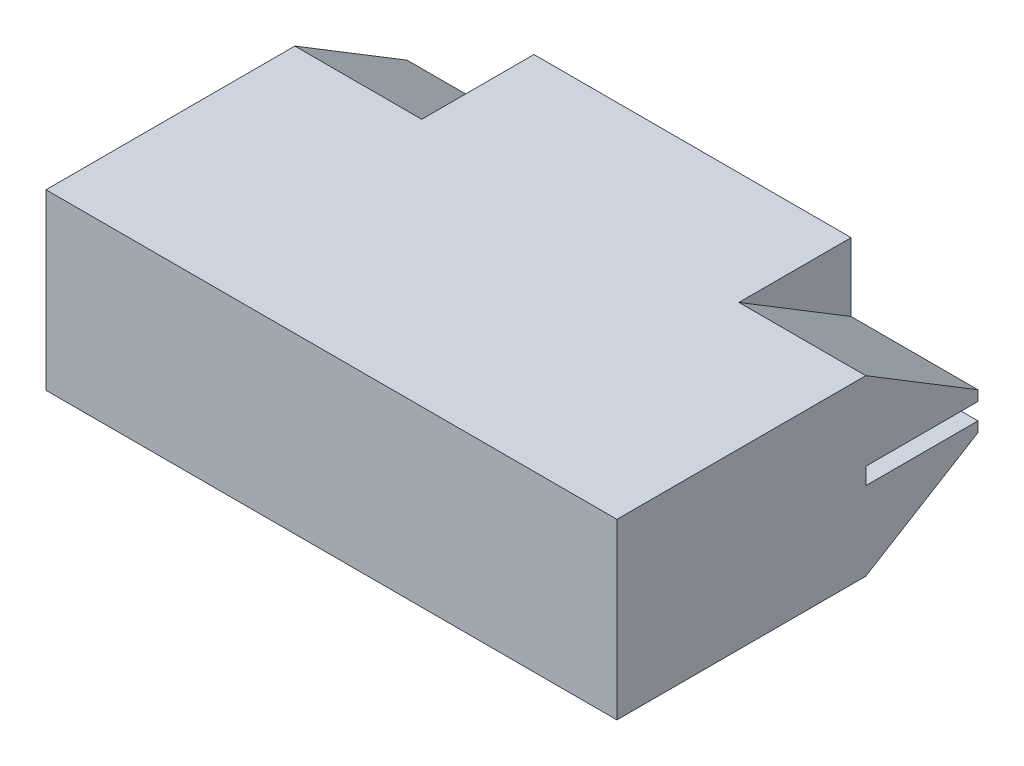
ISO-10303-21;
HEADER;
FILE_DESCRIPTION(('STEP AP214'),'2;1');
FILE_NAME('part.step','',(''),(''),'','','');
FILE_SCHEMA(('AUTOMOTIVE_DESIGN { 1 0 10303 214 1 1 1 1 }'));
ENDSEC;
DATA;
#1=APPLICATION_CONTEXT('core data for automotive mechanical design processes');
#2=APPLICATION_PROTOCOL_DEFINITION('international standard','automotive_design',2000,#1);
#3=PRODUCT_CONTEXT('',#1,'mechanical');
#4=PRODUCT('Part','Part','',(#3));
#5=PRODUCT_RELATED_PRODUCT_CATEGORY('part','',(#4));
#6=PRODUCT_DEFINITION_FORMATION('','',#4);
#7=PRODUCT_DEFINITION_CONTEXT('part definition',#1,'design');
#8=PRODUCT_DEFINITION('design','',#6,#7);
#9=PRODUCT_DEFINITION_SHAPE('','',#8);
#10=(LENGTH_UNIT() NAMED_UNIT(*) SI_UNIT(.MILLI.,.METRE.));
#11=(NAMED_UNIT(*) PLANE_ANGLE_UNIT() SI_UNIT($,.RADIAN.));
#12=(NAMED_UNIT(*) SI_UNIT($,.STERADIAN.) SOLID_ANGLE_UNIT());
#13=UNCERTAINTY_MEASURE_WITH_UNIT(LENGTH_MEASURE(1.E-05),#10,'distance_accuracy_value','');
#14=(GEOMETRIC_REPRESENTATION_CONTEXT(3) GLOBAL_UNCERTAINTY_ASSIGNED_CONTEXT((#13)) GLOBAL_UNIT_ASSIGNED_CONTEXT((#10,
#11,#12)) REPRESENTATION_CONTEXT('',''));
#15=CARTESIAN_POINT('',(0.,0.,0.));
#16=DIRECTION('',(0.,0.,1.));
#17=DIRECTION('',(1.,0.,0.));
#18=AXIS2_PLACEMENT_3D('',#15,#16,#17);
#19=CARTESIAN_POINT('',(6.625,-0.473000000000003,-3.2125));
#20=DIRECTION('',(1.,0.,0.));
#21=DIRECTION('',(0.,0.,-1.));
#22=AXIS2_PLACEMENT_3D('',#19,#20,#21);
#23=PLANE('',#22);
#24=DIRECTION('',(0.,0.,1.));
#25=VECTOR('',#24,1.);
#26=CARTESIAN_POINT('',(6.625,-0.430000000000002,-9.5375));
#27=LINE('',#26,#25);
#28=CARTESIAN_POINT('',(6.625,-0.430000000000002,-9.25000000000001));
#29=VERTEX_POINT('',#28);
#30=CARTESIAN_POINT('',(6.625,-0.430000000000002,-3.5));
#31=VERTEX_POINT('',#30);
#32=EDGE_CURVE('E226',#29,#31,#27,.T.);
#33=ORIENTED_EDGE('',*,*,#32,.F.);
#34=DIRECTION('',(0.,1.,0.));
#35=VECTOR('',#34,1.);
#36=CARTESIAN_POINT('',(6.625,-0.473000000000003,-9.25000000000001));
#37=LINE('',#36,#35);
#38=CARTESIAN_POINT('',(6.625,0.43,-9.25000000000001));
#39=VERTEX_POINT('',#38);
#40=EDGE_CURVE('E507',#29,#39,#37,.T.);
#41=ORIENTED_EDGE('',*,*,#40,.T.);
#42=DIRECTION('',(0.,0.,-1.));
#43=VECTOR('',#42,1.);
#44=CARTESIAN_POINT('',(6.625,0.43,-3.2125));
#45=LINE('',#44,#43);
#46=CARTESIAN_POINT('',(6.625,0.429999999999999,-3.5));
#47=VERTEX_POINT('',#46);
#48=EDGE_CURVE('E218',#47,#39,#45,.T.);
#49=ORIENTED_EDGE('',*,*,#48,.F.);
#50=DIRECTION('',(0.,1.,0.));
#51=VECTOR('',#50,1.);
#52=CARTESIAN_POINT('',(6.625,-0.473000000000003,-3.5));
#53=LINE('',#52,#51);
#54=EDGE_CURVE('E383',#31,#47,#53,.T.);
#55=ORIENTED_EDGE('',*,*,#54,.F.);
#56=EDGE_LOOP('',(#33,#41,#49,#55));
#57=FACE_BOUND('',#56,.T.);
#58=ADVANCED_FACE('F17',(#57),#23,.T.);
#59=CARTESIAN_POINT('',(15.025,-0.473000000000003,-3.5));
#60=DIRECTION('',(0.,0.,-1.));
#61=DIRECTION('',(-1.,0.,0.));
#62=AXIS2_PLACEMENT_3D('',#59,#60,#61);
#63=PLANE('',#62);
#64=DIRECTION('',(0.,1.,0.));
#65=VECTOR('',#64,1.);
#66=CARTESIAN_POINT('',(14.625,-4.895,-3.5));
#67=LINE('',#66,#65);
#68=CARTESIAN_POINT('',(14.625,-0.430000000000002,-3.5));
#69=VERTEX_POINT('',#68);
#70=CARTESIAN_POINT('',(14.625,0.429999999999998,-3.5));
#71=VERTEX_POINT('',#70);
#72=EDGE_CURVE('E194',#69,#71,#67,.T.);
#73=ORIENTED_EDGE('',*,*,#72,.F.);
#74=DIRECTION('',(1.,0.,0.));
#75=VECTOR('',#74,1.);
#76=CARTESIAN_POINT('',(6.22499999999999,-0.430000000000002,-3.5));
#77=LINE('',#76,#75);
#78=EDGE_CURVE('E236',#31,#69,#77,.T.);
#79=ORIENTED_EDGE('',*,*,#78,.F.);
#80=ORIENTED_EDGE('',*,*,#54,.T.);
#81=DIRECTION('',(1.,0.,0.));
#82=VECTOR('',#81,1.);
#83=CARTESIAN_POINT('',(6.22499999999999,0.43,-3.5));
#84=LINE('',#83,#82);
#85=EDGE_CURVE('E223',#71,#47,#84,.F.);
#86=ORIENTED_EDGE('',*,*,#85,.F.);
#87=EDGE_LOOP('',(#73,#79,#80,#86));
#88=FACE_BOUND('',#87,.T.);
#89=ADVANCED_FACE('F491',(#88),#63,.T.);
#90=CARTESIAN_POINT('',(14.625,-4.895,10.175));
#91=DIRECTION('',(1.,0.,0.));
#92=DIRECTION('',(0.,0.,-1.));
#93=AXIS2_PLACEMENT_3D('',#90,#91,#92);
#94=PLANE('',#93);
#95=DIRECTION('',(0.,0.,1.));
#96=VECTOR('',#95,1.);
#97=CARTESIAN_POINT('',(14.625,-0.430000000000002,-9.5375));
#98=LINE('',#97,#96);
#99=CARTESIAN_POINT('',(14.625,-0.430000000000002,-9.25000000000001));
#100=VERTEX_POINT('',#99);
#101=EDGE_CURVE('E232',#69,#100,#98,.F.);
#102=ORIENTED_EDGE('',*,*,#101,.F.);
#103=ORIENTED_EDGE('',*,*,#72,.T.);
#104=DIRECTION('',(0.,0.,-1.));
#105=VECTOR('',#104,1.);
#106=CARTESIAN_POINT('',(14.625,0.43,-3.2125));
#107=LINE('',#106,#105);
#108=CARTESIAN_POINT('',(14.625,0.429999999999998,-9.25000000000001));
#109=VERTEX_POINT('',#108);
#110=EDGE_CURVE('E227',#109,#71,#107,.F.);
#111=ORIENTED_EDGE('',*,*,#110,.F.);
#112=DIRECTION('',(0.,1.,0.));
#113=VECTOR('',#112,1.);
#114=CARTESIAN_POINT('',(14.625,-4.895,-9.25000000000001));
#115=LINE('',#114,#113);
#116=CARTESIAN_POINT('',(14.625,0.95,-9.25000000000001));
#117=VERTEX_POINT('',#116);
#118=EDGE_CURVE('E380',#109,#117,#115,.T.);
#119=ORIENTED_EDGE('',*,*,#118,.T.);
#120=DIRECTION('',(0.,-0.519946946895745,-0.854198555614439));
#121=VECTOR('',#120,1.);
#122=CARTESIAN_POINT('',(14.625,2.7,-6.375));
#123=LINE('',#122,#121);
#124=CARTESIAN_POINT('',(14.625,4.45000000000001,-3.5));
#125=VERTEX_POINT('',#124);
#126=EDGE_CURVE('E201',#125,#117,#123,.T.);
#127=ORIENTED_EDGE('',*,*,#126,.F.);
#128=DIRECTION('',(0.,0.,1.));
#129=VECTOR('',#128,1.);
#130=CARTESIAN_POINT('',(14.625,4.45000000000001,-10.175));
#131=LINE('',#130,#129);
#132=CARTESIAN_POINT('',(14.625,4.45000000000001,9.25000000000001));
#133=VERTEX_POINT('',#132);
#134=EDGE_CURVE('E197',#133,#125,#131,.F.);
#135=ORIENTED_EDGE('',*,*,#134,.F.);
#136=DIRECTION('',(0.,1.,0.));
#137=VECTOR('',#136,1.);
#138=CARTESIAN_POINT('',(14.625,-4.895,9.25000000000001));
#139=LINE('',#138,#137);
#140=CARTESIAN_POINT('',(14.625,-4.45000000000001,9.25000000000001));
#141=VERTEX_POINT('',#140);
#142=EDGE_CURVE('E184',#141,#133,#139,.T.);
#143=ORIENTED_EDGE('',*,*,#142,.F.);
#144=DIRECTION('',(0.,0.,-1.));
#145=VECTOR('',#144,1.);
#146=CARTESIAN_POINT('',(14.625,-4.45000000000001,10.175));
#147=LINE('',#146,#145);
#148=CARTESIAN_POINT('',(14.625,-4.45,-3.49999999999999));
#149=VERTEX_POINT('',#148);
#150=EDGE_CURVE('E246',#149,#141,#147,.F.);
#151=ORIENTED_EDGE('',*,*,#150,.F.);
#152=DIRECTION('',(0.,0.519946946895745,-0.854198555614439));
#153=VECTOR('',#152,1.);
#154=CARTESIAN_POINT('',(14.625,-4.62499999999999,-3.2125));
#155=LINE('',#154,#153);
#156=CARTESIAN_POINT('',(14.625,-0.949999999999999,-9.25000000000001));
#157=VERTEX_POINT('',#156);
#158=EDGE_CURVE('E235',#157,#149,#155,.F.);
#159=ORIENTED_EDGE('',*,*,#158,.F.);
#160=DIRECTION('',(0.,1.,0.));
#161=VECTOR('',#160,1.);
#162=CARTESIAN_POINT('',(14.625,-4.895,-9.25000000000001));
#163=LINE('',#162,#161);
#164=EDGE_CURVE('E376',#157,#100,#163,.T.);
#165=ORIENTED_EDGE('',*,*,#164,.T.);
#166=EDGE_LOOP('',(#102,#103,#111,#119,#127,#135,#143,#151,#159,#165));
#167=FACE_BOUND('',#166,.T.);
#168=ADVANCED_FACE('F199',(#167),#94,.T.);
#169=CARTESIAN_POINT('',(-16.0875,-4.895,9.25000000000001));
#170=DIRECTION('',(0.,0.,1.));
#171=DIRECTION('',(1.,0.,0.));
#172=AXIS2_PLACEMENT_3D('',#169,#170,#171);
#173=PLANE('',#172);
#174=DIRECTION('',(0.,1.,0.));
#175=VECTOR('',#174,1.);
#176=CARTESIAN_POINT('',(-14.625,-4.895,9.25000000000001));
#177=LINE('',#176,#175);
#178=CARTESIAN_POINT('',(-14.625,-4.45000000000001,9.25000000000001));
#179=VERTEX_POINT('',#178);
#180=CARTESIAN_POINT('',(-14.625,4.45000000000001,9.25000000000001));
#181=VERTEX_POINT('',#180);
#182=EDGE_CURVE('E264',#179,#181,#177,.T.);
#183=ORIENTED_EDGE('',*,*,#182,.F.);
#184=DIRECTION('',(1.,0.,0.));
#185=VECTOR('',#184,1.);
#186=CARTESIAN_POINT('',(-16.0875,-4.45000000000001,9.25000000000001));
#187=LINE('',#186,#185);
#188=EDGE_CURVE('E190',#141,#179,#187,.F.);
#189=ORIENTED_EDGE('',*,*,#188,.F.);
#190=ORIENTED_EDGE('',*,*,#142,.T.);
#191=DIRECTION('',(1.,0.,0.));
#192=VECTOR('',#191,1.);
#193=CARTESIAN_POINT('',(-16.0875,4.45000000000001,9.25000000000001));
#194=LINE('',#193,#192);
#195=EDGE_CURVE('E189',#181,#133,#194,.T.);
#196=ORIENTED_EDGE('',*,*,#195,.F.);
#197=EDGE_LOOP('',(#183,#189,#190,#196));
#198=FACE_BOUND('',#197,.T.);
#199=ADVANCED_FACE('F187',(#198),#173,.T.);
#200=CARTESIAN_POINT('',(-14.95,4.62499999999999,-3.2125));
#201=DIRECTION('',(0.,0.854198555614439,-0.519946946895745));
#202=DIRECTION('',(0.,0.519946946895745,0.854198555614439));
#203=AXIS2_PLACEMENT_3D('',#200,#201,#202);
#204=PLANE('',#203);
#205=DIRECTION('',(0.,-0.519946946895745,-0.854198555614439));
#206=VECTOR('',#205,1.);
#207=CARTESIAN_POINT('',(-14.625,4.45000000000001,-3.5));
#208=LINE('',#207,#206);
#209=CARTESIAN_POINT('',(-14.625,4.45,-3.5));
#210=VERTEX_POINT('',#209);
#211=CARTESIAN_POINT('',(-14.625,0.949999999999999,-9.25000000000001));
#212=VERTEX_POINT('',#211);
#213=EDGE_CURVE('E117',#210,#212,#208,.T.);
#214=ORIENTED_EDGE('',*,*,#213,.F.);
#215=DIRECTION('',(1.,0.,0.));
#216=VECTOR('',#215,1.);
#217=CARTESIAN_POINT('',(-16.0875,4.45000000000001,-3.5));
#218=LINE('',#217,#216);
#219=CARTESIAN_POINT('',(-8.12500000000001,4.45,-3.49999999999999));
#220=VERTEX_POINT('',#219);
#221=EDGE_CURVE('E124',#220,#210,#218,.F.);
#222=ORIENTED_EDGE('',*,*,#221,.F.);
#223=DIRECTION('',(0.,0.519946946895745,0.854198555614439));
#224=VECTOR('',#223,1.);
#225=CARTESIAN_POINT('',(-8.12500000000002,0.95,-9.25000000000001));
#226=LINE('',#225,#224);
#227=CARTESIAN_POINT('',(-8.12500000000001,0.949999999999997,-9.25000000000001));
#228=VERTEX_POINT('',#227);
#229=EDGE_CURVE('E112',#228,#220,#226,.T.);
#230=ORIENTED_EDGE('',*,*,#229,.F.);
#231=DIRECTION('',(-1.,0.,0.));
#232=VECTOR('',#231,1.);
#233=CARTESIAN_POINT('',(16.0875,0.95,-9.25000000000001));
#234=LINE('',#233,#232);
#235=EDGE_CURVE('E317',#212,#228,#234,.F.);
#236=ORIENTED_EDGE('',*,*,#235,.F.);
#237=EDGE_LOOP('',(#214,#222,#230,#236));
#238=FACE_BOUND('',#237,.T.);
#239=ADVANCED_FACE('F389',(#238),#204,.T.);
#240=CARTESIAN_POINT('',(-8.12500000000002,4.62499999999999,-3.2125));
#241=DIRECTION('',(-1.,0.,0.));
#242=DIRECTION('',(0.,0.,1.));
#243=AXIS2_PLACEMENT_3D('',#240,#241,#242);
#244=PLANE('',#243);
#245=DIRECTION('',(0.,0.,1.));
#246=VECTOR('',#245,1.);
#247=CARTESIAN_POINT('',(-8.12500000000002,4.45000000000001,-10.175));
#248=LINE('',#247,#246);
#249=CARTESIAN_POINT('',(-8.12500000000001,4.45000000000001,-9.25000000000001));
#250=VERTEX_POINT('',#249);
#251=EDGE_CURVE('E204',#250,#220,#248,.T.);
#252=ORIENTED_EDGE('',*,*,#251,.F.);
#253=DIRECTION('',(0.,1.,0.));
#254=VECTOR('',#253,1.);
#255=CARTESIAN_POINT('',(-8.12500000000001,-4.895,-9.25000000000001));
#256=LINE('',#255,#254);
#257=EDGE_CURVE('E314',#228,#250,#256,.T.);
#258=ORIENTED_EDGE('',*,*,#257,.F.);
#259=ORIENTED_EDGE('',*,*,#229,.T.);
#260=EDGE_LOOP('',(#252,#258,#259));
#261=FACE_BOUND('',#260,.T.);
#262=ADVANCED_FACE('F388',(#261),#244,.T.);
#263=CARTESIAN_POINT('',(-16.0875,4.45000000000001,-10.175));
#264=DIRECTION('',(0.,1.,0.));
#265=DIRECTION('',(0.,0.,1.));
#266=AXIS2_PLACEMENT_3D('',#263,#264,#265);
#267=PLANE('',#266);
#268=DIRECTION('',(-1.,0.,0.));
#269=VECTOR('',#268,1.);
#270=CARTESIAN_POINT('',(16.0875,4.45000000000001,-9.25000000000001));
#271=LINE('',#270,#269);
#272=CARTESIAN_POINT('',(8.12500000000002,4.45000000000001,-9.25000000000001));
#273=VERTEX_POINT('',#272);
#274=EDGE_CURVE('E311',#250,#273,#271,.F.);
#275=ORIENTED_EDGE('',*,*,#274,.F.);
#276=ORIENTED_EDGE('',*,*,#251,.T.);
#277=ORIENTED_EDGE('',*,*,#221,.T.);
#278=DIRECTION('',(0.,0.,1.));
#279=VECTOR('',#278,1.);
#280=CARTESIAN_POINT('',(-14.625,4.45000000000001,-10.175));
#281=LINE('',#280,#279);
#282=EDGE_CURVE('E208',#181,#210,#281,.F.);
#283=ORIENTED_EDGE('',*,*,#282,.F.);
#284=ORIENTED_EDGE('',*,*,#195,.T.);
#285=ORIENTED_EDGE('',*,*,#134,.T.);
#286=DIRECTION('',(1.,0.,0.));
#287=VECTOR('',#286,1.);
#288=CARTESIAN_POINT('',(11.375,4.45000000000001,-3.5));
#289=LINE('',#288,#287);
#290=CARTESIAN_POINT('',(8.12500000000001,4.45000000000001,-3.5));
#291=VERTEX_POINT('',#290);
#292=EDGE_CURVE('E219',#291,#125,#289,.T.);
#293=ORIENTED_EDGE('',*,*,#292,.F.);
#294=DIRECTION('',(0.,0.,1.));
#295=VECTOR('',#294,1.);
#296=CARTESIAN_POINT('',(8.12500000000002,4.45000000000001,-6.375));
#297=LINE('',#296,#295);
#298=EDGE_CURVE('E214',#273,#291,#297,.T.);
#299=ORIENTED_EDGE('',*,*,#298,.F.);
#300=EDGE_LOOP('',(#275,#276,#277,#283,#284,#285,#293,#299));
#301=FACE_BOUND('',#300,.T.);
#302=ADVANCED_FACE('F207',(#301),#267,.T.);
#303=CARTESIAN_POINT('',(8.12500000000002,0.95,-3.5));
#304=DIRECTION('',(1.,0.,0.));
#305=DIRECTION('',(0.,0.,-1.));
#306=AXIS2_PLACEMENT_3D('',#303,#304,#305);
#307=PLANE('',#306);
#308=DIRECTION('',(0.,1.,0.));
#309=VECTOR('',#308,1.);
#310=CARTESIAN_POINT('',(8.12500000000002,-4.895,-9.25000000000001));
#311=LINE('',#310,#309);
#312=CARTESIAN_POINT('',(8.12500000000001,0.95,-9.25000000000001));
#313=VERTEX_POINT('',#312);
#314=EDGE_CURVE('E308',#273,#313,#311,.F.);
#315=ORIENTED_EDGE('',*,*,#314,.F.);
#316=ORIENTED_EDGE('',*,*,#298,.T.);
#317=DIRECTION('',(0.,0.519946946895745,0.854198555614439));
#318=VECTOR('',#317,1.);
#319=CARTESIAN_POINT('',(8.12499999999999,2.7,-6.375));
#320=LINE('',#319,#318);
#321=EDGE_CURVE('E216',#313,#291,#320,.T.);
#322=ORIENTED_EDGE('',*,*,#321,.F.);
#323=EDGE_LOOP('',(#315,#316,#322));
#324=FACE_BOUND('',#323,.T.);
#325=ADVANCED_FACE('F352',(#324),#307,.T.);
#326=CARTESIAN_POINT('',(14.625,0.95,-9.25000000000001));
#327=DIRECTION('',(0.,0.854198555614439,-0.519946946895745));
#328=DIRECTION('',(-1.,0.,0.));
#329=AXIS2_PLACEMENT_3D('',#326,#327,#328);
#330=PLANE('',#329);
#331=ORIENTED_EDGE('',*,*,#126,.T.);
#332=DIRECTION('',(-1.,0.,0.));
#333=VECTOR('',#332,1.);
#334=CARTESIAN_POINT('',(16.0875,0.95,-9.25000000000001));
#335=LINE('',#334,#333);
#336=EDGE_CURVE('E305',#313,#117,#335,.F.);
#337=ORIENTED_EDGE('',*,*,#336,.F.);
#338=ORIENTED_EDGE('',*,*,#321,.T.);
#339=ORIENTED_EDGE('',*,*,#292,.T.);
#340=EDGE_LOOP('',(#331,#337,#338,#339));
#341=FACE_BOUND('',#340,.T.);
#342=ADVANCED_FACE('F355',(#341),#330,.T.);
#343=CARTESIAN_POINT('',(6.22499999999999,0.43,-3.2125));
#344=DIRECTION('',(0.,-1.,0.));
#345=DIRECTION('',(0.,0.,-1.));
#346=AXIS2_PLACEMENT_3D('',#343,#344,#345);
#347=PLANE('',#346);
#348=ORIENTED_EDGE('',*,*,#110,.T.);
#349=ORIENTED_EDGE('',*,*,#85,.T.);
#350=ORIENTED_EDGE('',*,*,#48,.T.);
#351=DIRECTION('',(-1.,0.,0.));
#352=VECTOR('',#351,1.);
#353=CARTESIAN_POINT('',(16.0875,0.43,-9.25000000000001));
#354=LINE('',#353,#352);
#355=EDGE_CURVE('E302',#109,#39,#354,.T.);
#356=ORIENTED_EDGE('',*,*,#355,.F.);
#357=EDGE_LOOP('',(#348,#349,#350,#356));
#358=FACE_BOUND('',#357,.T.);
#359=ADVANCED_FACE('F359',(#358),#347,.T.);
#360=CARTESIAN_POINT('',(6.22499999999999,-0.430000000000002,-9.5375));
#361=DIRECTION('',(0.,1.,0.));
#362=DIRECTION('',(0.,0.,1.));
#363=AXIS2_PLACEMENT_3D('',#360,#361,#362);
#364=PLANE('',#363);
#365=ORIENTED_EDGE('',*,*,#101,.T.);
#366=DIRECTION('',(-1.,0.,0.));
#367=VECTOR('',#366,1.);
#368=CARTESIAN_POINT('',(16.0875,-0.430000000000002,-9.25000000000001));
#369=LINE('',#368,#367);
#370=EDGE_CURVE('E299',#29,#100,#369,.F.);
#371=ORIENTED_EDGE('',*,*,#370,.F.);
#372=ORIENTED_EDGE('',*,*,#32,.T.);
#373=ORIENTED_EDGE('',*,*,#78,.T.);
#374=EDGE_LOOP('',(#365,#371,#372,#373));
#375=FACE_BOUND('',#374,.T.);
#376=ADVANCED_FACE('F404',(#375),#364,.T.);
#377=CARTESIAN_POINT('',(14.95,-4.62499999999999,-3.2125));
#378=DIRECTION('',(0.,-0.854198555614439,-0.519946946895745));
#379=DIRECTION('',(0.,0.519946946895745,-0.854198555614439));
#380=AXIS2_PLACEMENT_3D('',#377,#378,#379);
#381=PLANE('',#380);
#382=ORIENTED_EDGE('',*,*,#158,.T.);
#383=DIRECTION('',(1.,0.,0.));
#384=VECTOR('',#383,1.);
#385=CARTESIAN_POINT('',(-16.0875,-4.45000000000001,-3.5));
#386=LINE('',#385,#384);
#387=CARTESIAN_POINT('',(8.12500000000001,-4.45,-3.5));
#388=VERTEX_POINT('',#387);
#389=EDGE_CURVE('E248',#388,#149,#386,.T.);
#390=ORIENTED_EDGE('',*,*,#389,.F.);
#391=DIRECTION('',(0.,-0.519946946895745,0.854198555614439));
#392=VECTOR('',#391,1.);
#393=CARTESIAN_POINT('',(8.12500000000002,-0.95,-9.25000000000001));
#394=LINE('',#393,#392);
#395=CARTESIAN_POINT('',(8.12500000000001,-0.949999999999997,-9.25000000000001));
#396=VERTEX_POINT('',#395);
#397=EDGE_CURVE('E242',#396,#388,#394,.T.);
#398=ORIENTED_EDGE('',*,*,#397,.F.);
#399=DIRECTION('',(-1.,0.,0.));
#400=VECTOR('',#399,1.);
#401=CARTESIAN_POINT('',(16.0875,-0.95,-9.25000000000001));
#402=LINE('',#401,#400);
#403=EDGE_CURVE('E296',#157,#396,#402,.T.);
#404=ORIENTED_EDGE('',*,*,#403,.F.);
#405=EDGE_LOOP('',(#382,#390,#398,#404));
#406=FACE_BOUND('',#405,.T.);
#407=ADVANCED_FACE('F378',(#406),#381,.T.);
#408=CARTESIAN_POINT('',(8.12500000000002,-4.62499999999999,-3.2125));
#409=DIRECTION('',(1.,0.,0.));
#410=DIRECTION('',(0.,0.,-1.));
#411=AXIS2_PLACEMENT_3D('',#408,#409,#410);
#412=PLANE('',#411);
#413=DIRECTION('',(0.,0.,-1.));
#414=VECTOR('',#413,1.);
#415=CARTESIAN_POINT('',(8.12500000000001,-4.45000000000001,10.175));
#416=LINE('',#415,#414);
#417=CARTESIAN_POINT('',(8.12500000000001,-4.45000000000001,-9.25000000000001));
#418=VERTEX_POINT('',#417);
#419=EDGE_CURVE('E244',#418,#388,#416,.F.);
#420=ORIENTED_EDGE('',*,*,#419,.F.);
#421=DIRECTION('',(0.,1.,0.));
#422=VECTOR('',#421,1.);
#423=CARTESIAN_POINT('',(8.12500000000002,-4.895,-9.25000000000001));
#424=LINE('',#423,#422);
#425=EDGE_CURVE('E293',#396,#418,#424,.F.);
#426=ORIENTED_EDGE('',*,*,#425,.F.);
#427=ORIENTED_EDGE('',*,*,#397,.T.);
#428=EDGE_LOOP('',(#420,#426,#427));
#429=FACE_BOUND('',#428,.T.);
#430=ADVANCED_FACE('F411',(#429),#412,.T.);
#431=CARTESIAN_POINT('',(-16.0875,-4.45000000000001,10.175));
#432=DIRECTION('',(0.,-1.,0.));
#433=DIRECTION('',(0.,0.,-1.));
#434=AXIS2_PLACEMENT_3D('',#431,#432,#433);
#435=PLANE('',#434);
#436=ORIENTED_EDGE('',*,*,#188,.T.);
#437=DIRECTION('',(0.,0.,1.));
#438=VECTOR('',#437,1.);
#439=CARTESIAN_POINT('',(-14.625,-4.45000000000001,-10.175));
#440=LINE('',#439,#438);
#441=CARTESIAN_POINT('',(-14.625,-4.45000000000001,-3.5));
#442=VERTEX_POINT('',#441);
#443=EDGE_CURVE('E266',#442,#179,#440,.T.);
#444=ORIENTED_EDGE('',*,*,#443,.F.);
#445=DIRECTION('',(-1.,0.,0.));
#446=VECTOR('',#445,1.);
#447=CARTESIAN_POINT('',(-11.375,-4.45000000000001,-3.5));
#448=LINE('',#447,#446);
#449=CARTESIAN_POINT('',(-8.12500000000001,-4.45000000000001,-3.5));
#450=VERTEX_POINT('',#449);
#451=EDGE_CURVE('E138',#450,#442,#448,.T.);
#452=ORIENTED_EDGE('',*,*,#451,.F.);
#453=DIRECTION('',(0.,0.,1.));
#454=VECTOR('',#453,1.);
#455=CARTESIAN_POINT('',(-8.12500000000002,-4.45000000000001,-6.375));
#456=LINE('',#455,#454);
#457=CARTESIAN_POINT('',(-8.12500000000001,-4.45000000000001,-9.25000000000001));
#458=VERTEX_POINT('',#457);
#459=EDGE_CURVE('E150',#458,#450,#456,.T.);
#460=ORIENTED_EDGE('',*,*,#459,.F.);
#461=DIRECTION('',(-1.,0.,0.));
#462=VECTOR('',#461,1.);
#463=CARTESIAN_POINT('',(16.0875,-4.45000000000001,-9.25000000000001));
#464=LINE('',#463,#462);
#465=EDGE_CURVE('E290',#418,#458,#464,.T.);
#466=ORIENTED_EDGE('',*,*,#465,.F.);
#467=ORIENTED_EDGE('',*,*,#419,.T.);
#468=ORIENTED_EDGE('',*,*,#389,.T.);
#469=ORIENTED_EDGE('',*,*,#150,.T.);
#470=EDGE_LOOP('',(#436,#444,#452,#460,#466,#467,#468,#469));
#471=FACE_BOUND('',#470,.T.);
#472=ADVANCED_FACE('F364',(#471),#435,.T.);
#473=CARTESIAN_POINT('',(-8.12500000000002,-0.95,-3.5));
#474=DIRECTION('',(-1.,0.,0.));
#475=DIRECTION('',(0.,0.,-1.));
#476=AXIS2_PLACEMENT_3D('',#473,#474,#475);
#477=PLANE('',#476);
#478=DIRECTION('',(0.,1.,0.));
#479=VECTOR('',#478,1.);
#480=CARTESIAN_POINT('',(-8.12500000000001,-4.895,-9.25000000000001));
#481=LINE('',#480,#479);
#482=CARTESIAN_POINT('',(-8.12500000000001,-0.95,-9.25000000000001));
#483=VERTEX_POINT('',#482);
#484=EDGE_CURVE('E287',#458,#483,#481,.T.);
#485=ORIENTED_EDGE('',*,*,#484,.F.);
#486=ORIENTED_EDGE('',*,*,#459,.T.);
#487=DIRECTION('',(0.,-0.519946946895745,0.854198555614438));
#488=VECTOR('',#487,1.);
#489=CARTESIAN_POINT('',(-8.12499999999999,-2.7,-6.375));
#490=LINE('',#489,#488);
#491=EDGE_CURVE('E254',#483,#450,#490,.T.);
#492=ORIENTED_EDGE('',*,*,#491,.F.);
#493=EDGE_LOOP('',(#485,#486,#492));
#494=FACE_BOUND('',#493,.T.);
#495=ADVANCED_FACE('F361',(#494),#477,.T.);
#496=CARTESIAN_POINT('',(-14.625,-0.949999999999998,-9.25000000000001));
#497=DIRECTION('',(0.,-0.854198555614439,-0.519946946895745));
#498=DIRECTION('',(1.,0.,0.));
#499=AXIS2_PLACEMENT_3D('',#496,#497,#498);
#500=PLANE('',#499);
#501=DIRECTION('',(0.,-0.519946946895745,0.854198555614439));
#502=VECTOR('',#501,1.);
#503=CARTESIAN_POINT('',(-14.625,-0.95,-9.25000000000001));
#504=LINE('',#503,#502);
#505=CARTESIAN_POINT('',(-14.625,-0.949999999999999,-9.25000000000001));
#506=VERTEX_POINT('',#505);
#507=EDGE_CURVE('E269',#506,#442,#504,.T.);
#508=ORIENTED_EDGE('',*,*,#507,.F.);
#509=DIRECTION('',(-1.,0.,0.));
#510=VECTOR('',#509,1.);
#511=CARTESIAN_POINT('',(16.0875,-0.95,-9.25000000000001));
#512=LINE('',#511,#510);
#513=EDGE_CURVE('E284',#483,#506,#512,.T.);
#514=ORIENTED_EDGE('',*,*,#513,.F.);
#515=ORIENTED_EDGE('',*,*,#491,.T.);
#516=ORIENTED_EDGE('',*,*,#451,.T.);
#517=EDGE_LOOP('',(#508,#514,#515,#516));
#518=FACE_BOUND('',#517,.T.);
#519=ADVANCED_FACE('F339',(#518),#500,.T.);
#520=CARTESIAN_POINT('',(-14.625,-0.430000000000002,-9.25000000000001));
#521=DIRECTION('',(0.,1.,0.));
#522=DIRECTION('',(0.,0.,1.));
#523=AXIS2_PLACEMENT_3D('',#520,#521,#522);
#524=PLANE('',#523);
#525=DIRECTION('',(0.,0.,1.));
#526=VECTOR('',#525,1.);
#527=CARTESIAN_POINT('',(-14.625,-0.430000000000002,-10.175));
#528=LINE('',#527,#526);
#529=CARTESIAN_POINT('',(-14.625,-0.430000000000002,-3.5));
#530=VERTEX_POINT('',#529);
#531=CARTESIAN_POINT('',(-14.625,-0.430000000000002,-9.25000000000001));
#532=VERTEX_POINT('',#531);
#533=EDGE_CURVE('E272',#530,#532,#528,.F.);
#534=ORIENTED_EDGE('',*,*,#533,.F.);
#535=DIRECTION('',(-1.,0.,0.));
#536=VECTOR('',#535,1.);
#537=CARTESIAN_POINT('',(-10.625,-0.430000000000002,-3.5));
#538=LINE('',#537,#536);
#539=CARTESIAN_POINT('',(-6.625,-0.430000000000002,-3.5));
#540=VERTEX_POINT('',#539);
#541=EDGE_CURVE('E143',#540,#530,#538,.T.);
#542=ORIENTED_EDGE('',*,*,#541,.F.);
#543=DIRECTION('',(0.,0.,1.));
#544=VECTOR('',#543,1.);
#545=CARTESIAN_POINT('',(-6.625,-0.430000000000002,-6.375));
#546=LINE('',#545,#544);
#547=CARTESIAN_POINT('',(-6.625,-0.430000000000002,-9.25000000000001));
#548=VERTEX_POINT('',#547);
#549=EDGE_CURVE('E58',#548,#540,#546,.T.);
#550=ORIENTED_EDGE('',*,*,#549,.F.);
#551=DIRECTION('',(-1.,0.,0.));
#552=VECTOR('',#551,1.);
#553=CARTESIAN_POINT('',(16.0875,-0.430000000000002,-9.25000000000001));
#554=LINE('',#553,#552);
#555=EDGE_CURVE('E278',#532,#548,#554,.F.);
#556=ORIENTED_EDGE('',*,*,#555,.F.);
#557=EDGE_LOOP('',(#534,#542,#550,#556));
#558=FACE_BOUND('',#557,.T.);
#559=ADVANCED_FACE('F331',(#558),#524,.T.);
#560=CARTESIAN_POINT('',(-6.625,0.43,-3.5));
#561=DIRECTION('',(-1.,0.,0.));
#562=DIRECTION('',(0.,0.,-1.));
#563=AXIS2_PLACEMENT_3D('',#560,#561,#562);
#564=PLANE('',#563);
#565=ORIENTED_EDGE('',*,*,#549,.T.);
#566=DIRECTION('',(0.,-1.,0.));
#567=VECTOR('',#566,1.);
#568=CARTESIAN_POINT('',(-6.625,0.,-3.5));
#569=LINE('',#568,#567);
#570=CARTESIAN_POINT('',(-6.625,0.429999999999998,-3.5));
#571=VERTEX_POINT('',#570);
#572=EDGE_CURVE('E258',#571,#540,#569,.T.);
#573=ORIENTED_EDGE('',*,*,#572,.F.);
#574=DIRECTION('',(0.,0.,1.));
#575=VECTOR('',#574,1.);
#576=CARTESIAN_POINT('',(-6.625,0.429999999999998,-6.375));
#577=LINE('',#576,#575);
#578=CARTESIAN_POINT('',(-6.625,0.43,-9.25000000000001));
#579=VERTEX_POINT('',#578);
#580=EDGE_CURVE('E21',#579,#571,#577,.T.);
#581=ORIENTED_EDGE('',*,*,#580,.F.);
#582=DIRECTION('',(0.,1.,0.));
#583=VECTOR('',#582,1.);
#584=CARTESIAN_POINT('',(-6.625,-4.895,-9.25000000000001));
#585=LINE('',#584,#583);
#586=EDGE_CURVE('E276',#548,#579,#585,.T.);
#587=ORIENTED_EDGE('',*,*,#586,.F.);
#588=EDGE_LOOP('',(#565,#573,#581,#587));
#589=FACE_BOUND('',#588,.T.);
#590=ADVANCED_FACE('F328',(#589),#564,.T.);
#591=CARTESIAN_POINT('',(-14.625,0.429999999999997,-3.5));
#592=DIRECTION('',(0.,0.,-1.));
#593=DIRECTION('',(1.,0.,0.));
#594=AXIS2_PLACEMENT_3D('',#591,#592,#593);
#595=PLANE('',#594);
#596=DIRECTION('',(0.,1.,0.));
#597=VECTOR('',#596,1.);
#598=CARTESIAN_POINT('',(-14.625,-4.895,-3.5));
#599=LINE('',#598,#597);
#600=CARTESIAN_POINT('',(-14.625,0.429999999999998,-3.5));
#601=VERTEX_POINT('',#600);
#602=EDGE_CURVE('E260',#601,#530,#599,.F.);
#603=ORIENTED_EDGE('',*,*,#602,.F.);
#604=DIRECTION('',(-1.,0.,0.));
#605=VECTOR('',#604,1.);
#606=CARTESIAN_POINT('',(-10.625,0.429999999999997,-3.5));
#607=LINE('',#606,#605);
#608=EDGE_CURVE('E322',#571,#601,#607,.T.);
#609=ORIENTED_EDGE('',*,*,#608,.F.);
#610=ORIENTED_EDGE('',*,*,#572,.T.);
#611=ORIENTED_EDGE('',*,*,#541,.T.);
#612=EDGE_LOOP('',(#603,#609,#610,#611));
#613=FACE_BOUND('',#612,.T.);
#614=ADVANCED_FACE('F330',(#613),#595,.T.);
#615=CARTESIAN_POINT('',(-14.625,-4.895,-10.175));
#616=DIRECTION('',(-1.,0.,0.));
#617=DIRECTION('',(0.,0.,1.));
#618=AXIS2_PLACEMENT_3D('',#615,#616,#617);
#619=PLANE('',#618);
#620=ORIENTED_EDGE('',*,*,#213,.T.);
#621=DIRECTION('',(0.,1.,0.));
#622=VECTOR('',#621,1.);
#623=CARTESIAN_POINT('',(-14.625,-4.895,-9.25000000000001));
#624=LINE('',#623,#622);
#625=CARTESIAN_POINT('',(-14.625,0.43,-9.25000000000001));
#626=VERTEX_POINT('',#625);
#627=EDGE_CURVE('E36',#626,#212,#624,.T.);
#628=ORIENTED_EDGE('',*,*,#627,.F.);
#629=DIRECTION('',(0.,0.,-1.));
#630=VECTOR('',#629,1.);
#631=CARTESIAN_POINT('',(-14.625,0.429999999999998,-6.375));
#632=LINE('',#631,#630);
#633=EDGE_CURVE('E27',#601,#626,#632,.T.);
#634=ORIENTED_EDGE('',*,*,#633,.F.);
#635=ORIENTED_EDGE('',*,*,#602,.T.);
#636=ORIENTED_EDGE('',*,*,#533,.T.);
#637=DIRECTION('',(0.,1.,0.));
#638=VECTOR('',#637,1.);
#639=CARTESIAN_POINT('',(-14.625,-4.895,-9.25000000000001));
#640=LINE('',#639,#638);
#641=EDGE_CURVE('E281',#506,#532,#640,.T.);
#642=ORIENTED_EDGE('',*,*,#641,.F.);
#643=ORIENTED_EDGE('',*,*,#507,.T.);
#644=ORIENTED_EDGE('',*,*,#443,.T.);
#645=ORIENTED_EDGE('',*,*,#182,.T.);
#646=ORIENTED_EDGE('',*,*,#282,.T.);
#647=EDGE_LOOP('',(#620,#628,#634,#635,#636,#642,#643,#644,#645,#646));
#648=FACE_BOUND('',#647,.T.);
#649=ADVANCED_FACE('F338',(#648),#619,.T.);
#650=CARTESIAN_POINT('',(16.0875,-4.895,-9.25000000000001));
#651=DIRECTION('',(0.,0.,-1.));
#652=DIRECTION('',(-1.,0.,0.));
#653=AXIS2_PLACEMENT_3D('',#650,#651,#652);
#654=PLANE('',#653);
#655=ORIENTED_EDGE('',*,*,#555,.T.);
#656=ORIENTED_EDGE('',*,*,#586,.T.);
#657=DIRECTION('',(1.,0.,0.));
#658=VECTOR('',#657,1.);
#659=CARTESIAN_POINT('',(-10.625,0.43,-9.25000000000001));
#660=LINE('',#659,#658);
#661=EDGE_CURVE('E11',#626,#579,#660,.T.);
#662=ORIENTED_EDGE('',*,*,#661,.F.);
#663=ORIENTED_EDGE('',*,*,#627,.T.);
#664=ORIENTED_EDGE('',*,*,#235,.T.);
#665=ORIENTED_EDGE('',*,*,#257,.T.);
#666=ORIENTED_EDGE('',*,*,#274,.T.);
#667=ORIENTED_EDGE('',*,*,#314,.T.);
#668=ORIENTED_EDGE('',*,*,#336,.T.);
#669=ORIENTED_EDGE('',*,*,#118,.F.);
#670=ORIENTED_EDGE('',*,*,#355,.T.);
#671=ORIENTED_EDGE('',*,*,#40,.F.);
#672=ORIENTED_EDGE('',*,*,#370,.T.);
#673=ORIENTED_EDGE('',*,*,#164,.F.);
#674=ORIENTED_EDGE('',*,*,#403,.T.);
#675=ORIENTED_EDGE('',*,*,#425,.T.);
#676=ORIENTED_EDGE('',*,*,#465,.T.);
#677=ORIENTED_EDGE('',*,*,#484,.T.);
#678=ORIENTED_EDGE('',*,*,#513,.T.);
#679=ORIENTED_EDGE('',*,*,#641,.T.);
#680=EDGE_LOOP('',(#655,#656,#662,#663,#664,#665,#666,#667,#668,#669,#670,#671,#672,#673,#674,
#675,#676,#677,#678,#679));
#681=FACE_BOUND('',#680,.T.);
#682=ADVANCED_FACE('F327',(#681),#654,.T.);
#683=CARTESIAN_POINT('',(-14.625,0.429999999999997,-3.5));
#684=DIRECTION('',(0.,-1.,0.));
#685=DIRECTION('',(0.,0.,-1.));
#686=AXIS2_PLACEMENT_3D('',#683,#684,#685);
#687=PLANE('',#686);
#688=ORIENTED_EDGE('',*,*,#633,.T.);
#689=ORIENTED_EDGE('',*,*,#661,.T.);
#690=ORIENTED_EDGE('',*,*,#580,.T.);
#691=ORIENTED_EDGE('',*,*,#608,.T.);
#692=EDGE_LOOP('',(#688,#689,#690,#691));
#693=FACE_BOUND('',#692,.T.);
#694=ADVANCED_FACE('F19',(#693),#687,.T.);
#695=CLOSED_SHELL('',(#58,#89,#168,#199,#239,#262,#302,#325,#342,#359,#376,#407,#430,#472,#495,
#519,#559,#590,#614,#649,#682,#694));
#696=MANIFOLD_SOLID_BREP('B1',#695);
#697=ADVANCED_BREP_SHAPE_REPRESENTATION('',(#18,#696),#14);
#698=SHAPE_DEFINITION_REPRESENTATION(#9,#697);
ENDSEC;
END-ISO-10303-21;
